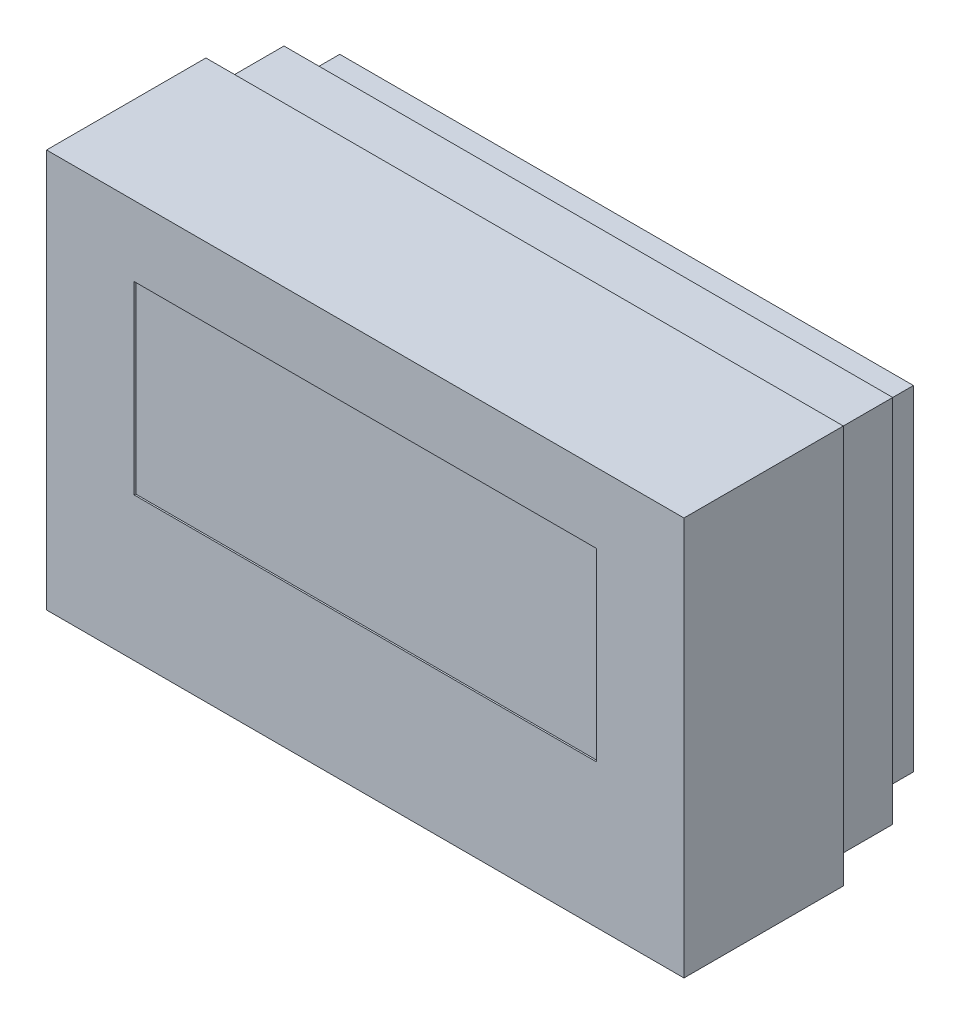
ISO-10303-21;
HEADER;
FILE_DESCRIPTION(('STEP AP214'),'2;1');
FILE_NAME('part.step','',(''),(''),'','','');
FILE_SCHEMA(('AUTOMOTIVE_DESIGN { 1 0 10303 214 1 1 1 1 }'));
ENDSEC;
DATA;
#1=APPLICATION_CONTEXT('core data for automotive mechanical design processes');
#2=APPLICATION_PROTOCOL_DEFINITION('international standard','automotive_design',2000,#1);
#3=PRODUCT_CONTEXT('',#1,'mechanical');
#4=PRODUCT('Part','Part','',(#3));
#5=PRODUCT_RELATED_PRODUCT_CATEGORY('part','',(#4));
#6=PRODUCT_DEFINITION_FORMATION('','',#4);
#7=PRODUCT_DEFINITION_CONTEXT('part definition',#1,'design');
#8=PRODUCT_DEFINITION('design','',#6,#7);
#9=PRODUCT_DEFINITION_SHAPE('','',#8);
#10=(LENGTH_UNIT() NAMED_UNIT(*) SI_UNIT(.MILLI.,.METRE.));
#11=(NAMED_UNIT(*) PLANE_ANGLE_UNIT() SI_UNIT($,.RADIAN.));
#12=(NAMED_UNIT(*) SI_UNIT($,.STERADIAN.) SOLID_ANGLE_UNIT());
#13=UNCERTAINTY_MEASURE_WITH_UNIT(LENGTH_MEASURE(1.E-05),#10,'distance_accuracy_value','');
#14=(GEOMETRIC_REPRESENTATION_CONTEXT(3) GLOBAL_UNCERTAINTY_ASSIGNED_CONTEXT((#13)) GLOBAL_UNIT_ASSIGNED_CONTEXT((#10,
#11,#12)) REPRESENTATION_CONTEXT('',''));
#15=CARTESIAN_POINT('',(0.,0.,0.));
#16=DIRECTION('',(0.,0.,1.));
#17=DIRECTION('',(1.,0.,0.));
#18=AXIS2_PLACEMENT_3D('',#15,#16,#17);
#19=CARTESIAN_POINT('',(19.1,-11.6,-4.));
#20=DIRECTION('',(0.,1.,0.));
#21=DIRECTION('',(0.,0.,1.));
#22=AXIS2_PLACEMENT_3D('',#19,#20,#21);
#23=PLANE('',#22);
#24=DIRECTION('',(-1.,0.,0.));
#25=VECTOR('',#24,1.);
#26=CARTESIAN_POINT('',(19.1,-11.6,-4.));
#27=LINE('',#26,#25);
#28=CARTESIAN_POINT('',(-5.50000000000004,-11.6,-4.));
#29=VERTEX_POINT('',#28);
#30=CARTESIAN_POINT('',(-19.1,-11.6,-4.));
#31=VERTEX_POINT('',#30);
#32=EDGE_CURVE('E281',#29,#31,#27,.T.);
#33=ORIENTED_EDGE('',*,*,#32,.F.);
#34=DIRECTION('',(-0.707106781186544,0.,0.707106781186551));
#35=VECTOR('',#34,1.);
#36=CARTESIAN_POINT('',(6.79999999999986,-11.6,-16.3));
#37=LINE('',#36,#35);
#38=CARTESIAN_POINT('',(-9.50000000000001,-11.6,0.));
#39=VERTEX_POINT('',#38);
#40=EDGE_CURVE('E233',#29,#39,#37,.T.);
#41=ORIENTED_EDGE('',*,*,#40,.T.);
#42=DIRECTION('',(-1.,0.,0.));
#43=VECTOR('',#42,1.);
#44=CARTESIAN_POINT('',(19.1,-11.6,0.));
#45=LINE('',#44,#43);
#46=CARTESIAN_POINT('',(-19.1,-11.6,0.));
#47=VERTEX_POINT('',#46);
#48=EDGE_CURVE('E294',#39,#47,#45,.T.);
#49=ORIENTED_EDGE('',*,*,#48,.T.);
#50=DIRECTION('',(0.,0.,1.));
#51=VECTOR('',#50,1.);
#52=CARTESIAN_POINT('',(-19.1,-11.6,-4.));
#53=LINE('',#52,#51);
#54=EDGE_CURVE('E285',#31,#47,#53,.T.);
#55=ORIENTED_EDGE('',*,*,#54,.F.);
#56=EDGE_LOOP('',(#33,#41,#49,#55));
#57=FACE_BOUND('',#56,.T.);
#58=ADVANCED_FACE('F35',(#57),#23,.F.);
#59=CARTESIAN_POINT('',(0.,0.,0.));
#60=DIRECTION('',(0.,0.,1.));
#61=DIRECTION('',(1.,0.,0.));
#62=AXIS2_PLACEMENT_3D('',#59,#60,#61);
#63=PLANE('',#62);
#64=ORIENTED_EDGE('',*,*,#48,.F.);
#65=DIRECTION('',(0.,-1.,0.));
#66=VECTOR('',#65,1.);
#67=CARTESIAN_POINT('',(-9.50000000000001,14.0153013442625,0.));
#68=LINE('',#67,#66);
#69=CARTESIAN_POINT('',(-9.50000000000001,-12.5,0.));
#70=VERTEX_POINT('',#69);
#71=EDGE_CURVE('E223',#39,#70,#68,.T.);
#72=ORIENTED_EDGE('',*,*,#71,.T.);
#73=DIRECTION('',(1.,0.,0.));
#74=VECTOR('',#73,1.);
#75=CARTESIAN_POINT('',(-20.,-12.5,0.));
#76=LINE('',#75,#74);
#77=CARTESIAN_POINT('',(-20.,-12.5,0.));
#78=VERTEX_POINT('',#77);
#79=EDGE_CURVE('E343',#78,#70,#76,.T.);
#80=ORIENTED_EDGE('',*,*,#79,.F.);
#81=DIRECTION('',(0.,-1.,0.));
#82=VECTOR('',#81,1.);
#83=CARTESIAN_POINT('',(-20.,12.5,0.));
#84=LINE('',#83,#82);
#85=CARTESIAN_POINT('',(-20.,12.5,0.));
#86=VERTEX_POINT('',#85);
#87=EDGE_CURVE('E354',#86,#78,#84,.T.);
#88=ORIENTED_EDGE('',*,*,#87,.F.);
#89=DIRECTION('',(-1.,0.,0.));
#90=VECTOR('',#89,1.);
#91=CARTESIAN_POINT('',(-20.,12.5,0.));
#92=LINE('',#91,#90);
#93=CARTESIAN_POINT('',(20.,12.5,0.));
#94=VERTEX_POINT('',#93);
#95=EDGE_CURVE('E352',#94,#86,#92,.T.);
#96=ORIENTED_EDGE('',*,*,#95,.F.);
#97=DIRECTION('',(0.,1.,0.));
#98=VECTOR('',#97,1.);
#99=CARTESIAN_POINT('',(20.,12.5,0.));
#100=LINE('',#99,#98);
#101=CARTESIAN_POINT('',(20.,-12.5,0.));
#102=VERTEX_POINT('',#101);
#103=EDGE_CURVE('E332',#102,#94,#100,.T.);
#104=ORIENTED_EDGE('',*,*,#103,.F.);
#105=CARTESIAN_POINT('',(14.5,-12.5,0.));
#106=VERTEX_POINT('',#105);
#107=EDGE_CURVE('E356',#106,#102,#76,.T.);
#108=ORIENTED_EDGE('',*,*,#107,.F.);
#109=DIRECTION('',(0.,-1.,0.));
#110=VECTOR('',#109,1.);
#111=CARTESIAN_POINT('',(14.5,14.0153013442625,0.));
#112=LINE('',#111,#110);
#113=CARTESIAN_POINT('',(14.5,-11.6,0.));
#114=VERTEX_POINT('',#113);
#115=EDGE_CURVE('E222',#114,#106,#112,.T.);
#116=ORIENTED_EDGE('',*,*,#115,.F.);
#117=CARTESIAN_POINT('',(19.1,-11.6,0.));
#118=VERTEX_POINT('',#117);
#119=EDGE_CURVE('E277',#118,#114,#45,.T.);
#120=ORIENTED_EDGE('',*,*,#119,.F.);
#121=DIRECTION('',(0.,-1.,0.));
#122=VECTOR('',#121,1.);
#123=CARTESIAN_POINT('',(19.1,11.6,0.));
#124=LINE('',#123,#122);
#125=CARTESIAN_POINT('',(19.1,11.6,0.));
#126=VERTEX_POINT('',#125);
#127=EDGE_CURVE('E291',#126,#118,#124,.T.);
#128=ORIENTED_EDGE('',*,*,#127,.F.);
#129=DIRECTION('',(1.,0.,0.));
#130=VECTOR('',#129,1.);
#131=CARTESIAN_POINT('',(19.1,11.6,0.));
#132=LINE('',#131,#130);
#133=CARTESIAN_POINT('',(-19.1,11.6,0.));
#134=VERTEX_POINT('',#133);
#135=EDGE_CURVE('E288',#134,#126,#132,.T.);
#136=ORIENTED_EDGE('',*,*,#135,.F.);
#137=DIRECTION('',(0.,1.,0.));
#138=VECTOR('',#137,1.);
#139=CARTESIAN_POINT('',(-19.1,11.6,0.));
#140=LINE('',#139,#138);
#141=EDGE_CURVE('E272',#47,#134,#140,.T.);
#142=ORIENTED_EDGE('',*,*,#141,.F.);
#143=EDGE_LOOP('',(#64,#72,#80,#88,#96,#104,#108,#116,#120,#128,#136,#142));
#144=FACE_BOUND('',#143,.T.);
#145=ADVANCED_FACE('F395',(#144),#63,.F.);
#146=CARTESIAN_POINT('',(20.,12.5,10.));
#147=DIRECTION('',(-1.,0.,0.));
#148=DIRECTION('',(0.,0.,1.));
#149=AXIS2_PLACEMENT_3D('',#146,#147,#148);
#150=PLANE('',#149);
#151=ORIENTED_EDGE('',*,*,#103,.T.);
#152=DIRECTION('',(0.,0.,-1.));
#153=VECTOR('',#152,1.);
#154=CARTESIAN_POINT('',(20.,12.5,10.));
#155=LINE('',#154,#153);
#156=CARTESIAN_POINT('',(20.,12.5,10.));
#157=VERTEX_POINT('',#156);
#158=EDGE_CURVE('E206',#157,#94,#155,.T.);
#159=ORIENTED_EDGE('',*,*,#158,.F.);
#160=DIRECTION('',(0.,1.,0.));
#161=VECTOR('',#160,1.);
#162=CARTESIAN_POINT('',(20.,12.5,10.));
#163=LINE('',#162,#161);
#164=CARTESIAN_POINT('',(20.,-12.5,10.));
#165=VERTEX_POINT('',#164);
#166=EDGE_CURVE('E339',#165,#157,#163,.T.);
#167=ORIENTED_EDGE('',*,*,#166,.F.);
#168=DIRECTION('',(0.,0.,-1.));
#169=VECTOR('',#168,1.);
#170=CARTESIAN_POINT('',(20.,-12.5,10.));
#171=LINE('',#170,#169);
#172=EDGE_CURVE('E349',#165,#102,#171,.T.);
#173=ORIENTED_EDGE('',*,*,#172,.T.);
#174=EDGE_LOOP('',(#151,#159,#167,#173));
#175=FACE_BOUND('',#174,.T.);
#176=ADVANCED_FACE('F413',(#175),#150,.F.);
#177=CARTESIAN_POINT('',(-20.,12.5,10.));
#178=DIRECTION('',(0.,-1.,0.));
#179=DIRECTION('',(0.,0.,-1.));
#180=AXIS2_PLACEMENT_3D('',#177,#178,#179);
#181=PLANE('',#180);
#182=ORIENTED_EDGE('',*,*,#95,.T.);
#183=DIRECTION('',(0.,0.,-1.));
#184=VECTOR('',#183,1.);
#185=CARTESIAN_POINT('',(-20.,12.5,10.));
#186=LINE('',#185,#184);
#187=CARTESIAN_POINT('',(-20.,12.5,10.));
#188=VERTEX_POINT('',#187);
#189=EDGE_CURVE('E364',#188,#86,#186,.T.);
#190=ORIENTED_EDGE('',*,*,#189,.F.);
#191=DIRECTION('',(-1.,0.,0.));
#192=VECTOR('',#191,1.);
#193=CARTESIAN_POINT('',(-20.,12.5,10.));
#194=LINE('',#193,#192);
#195=EDGE_CURVE('E342',#157,#188,#194,.T.);
#196=ORIENTED_EDGE('',*,*,#195,.F.);
#197=ORIENTED_EDGE('',*,*,#158,.T.);
#198=EDGE_LOOP('',(#182,#190,#196,#197));
#199=FACE_BOUND('',#198,.T.);
#200=ADVANCED_FACE('F410',(#199),#181,.F.);
#201=CARTESIAN_POINT('',(-20.,12.5,10.));
#202=DIRECTION('',(1.,0.,0.));
#203=DIRECTION('',(0.,0.,-1.));
#204=AXIS2_PLACEMENT_3D('',#201,#202,#203);
#205=PLANE('',#204);
#206=ORIENTED_EDGE('',*,*,#87,.T.);
#207=DIRECTION('',(0.,0.,-1.));
#208=VECTOR('',#207,1.);
#209=CARTESIAN_POINT('',(-20.,-12.5,10.));
#210=LINE('',#209,#208);
#211=CARTESIAN_POINT('',(-20.,-12.5,10.));
#212=VERTEX_POINT('',#211);
#213=EDGE_CURVE('E361',#212,#78,#210,.T.);
#214=ORIENTED_EDGE('',*,*,#213,.F.);
#215=DIRECTION('',(0.,-1.,0.));
#216=VECTOR('',#215,1.);
#217=CARTESIAN_POINT('',(-20.,12.5,10.));
#218=LINE('',#217,#216);
#219=EDGE_CURVE('E345',#188,#212,#218,.T.);
#220=ORIENTED_EDGE('',*,*,#219,.F.);
#221=ORIENTED_EDGE('',*,*,#189,.T.);
#222=EDGE_LOOP('',(#206,#214,#220,#221));
#223=FACE_BOUND('',#222,.T.);
#224=ADVANCED_FACE('F405',(#223),#205,.F.);
#225=CARTESIAN_POINT('',(-20.,-12.5,10.));
#226=DIRECTION('',(0.,1.,0.));
#227=DIRECTION('',(0.,0.,1.));
#228=AXIS2_PLACEMENT_3D('',#225,#226,#227);
#229=PLANE('',#228);
#230=ORIENTED_EDGE('',*,*,#79,.T.);
#231=DIRECTION('',(1.,0.,0.));
#232=VECTOR('',#231,1.);
#233=CARTESIAN_POINT('',(-20.,-12.5,0.));
#234=LINE('',#233,#232);
#235=EDGE_CURVE('E236',#70,#106,#234,.T.);
#236=ORIENTED_EDGE('',*,*,#235,.T.);
#237=ORIENTED_EDGE('',*,*,#107,.T.);
#238=ORIENTED_EDGE('',*,*,#172,.F.);
#239=DIRECTION('',(1.,0.,0.));
#240=VECTOR('',#239,1.);
#241=CARTESIAN_POINT('',(-20.,-12.5,10.));
#242=LINE('',#241,#240);
#243=EDGE_CURVE('E347',#212,#165,#242,.T.);
#244=ORIENTED_EDGE('',*,*,#243,.F.);
#245=ORIENTED_EDGE('',*,*,#213,.T.);
#246=EDGE_LOOP('',(#230,#236,#237,#238,#244,#245));
#247=FACE_BOUND('',#246,.T.);
#248=ADVANCED_FACE('F399',(#247),#229,.F.);
#249=CARTESIAN_POINT('',(0.,0.,10.));
#250=DIRECTION('',(0.,0.,1.));
#251=DIRECTION('',(1.,0.,0.));
#252=AXIS2_PLACEMENT_3D('',#249,#250,#251);
#253=PLANE('',#252);
#254=DIRECTION('',(1.,0.,0.));
#255=VECTOR('',#254,1.);
#256=CARTESIAN_POINT('',(-14.5,-3.5,10.));
#257=LINE('',#256,#255);
#258=CARTESIAN_POINT('',(-14.5,-3.5,10.));
#259=VERTEX_POINT('',#258);
#260=CARTESIAN_POINT('',(14.5,-3.5,10.));
#261=VERTEX_POINT('',#260);
#262=EDGE_CURVE('E308',#259,#261,#257,.T.);
#263=ORIENTED_EDGE('',*,*,#262,.F.);
#264=DIRECTION('',(0.,-1.,0.));
#265=VECTOR('',#264,1.);
#266=CARTESIAN_POINT('',(-14.5,8.1,10.));
#267=LINE('',#266,#265);
#268=CARTESIAN_POINT('',(-14.5,8.1,10.));
#269=VERTEX_POINT('',#268);
#270=EDGE_CURVE('E313',#269,#259,#267,.T.);
#271=ORIENTED_EDGE('',*,*,#270,.F.);
#272=DIRECTION('',(1.,0.,0.));
#273=VECTOR('',#272,1.);
#274=CARTESIAN_POINT('',(-14.5,8.1,10.));
#275=LINE('',#274,#273);
#276=CARTESIAN_POINT('',(14.5,8.1,10.));
#277=VERTEX_POINT('',#276);
#278=EDGE_CURVE('E325',#269,#277,#275,.T.);
#279=ORIENTED_EDGE('',*,*,#278,.T.);
#280=DIRECTION('',(0.,-1.,0.));
#281=VECTOR('',#280,1.);
#282=CARTESIAN_POINT('',(14.5,8.1,10.));
#283=LINE('',#282,#281);
#284=EDGE_CURVE('E322',#277,#261,#283,.T.);
#285=ORIENTED_EDGE('',*,*,#284,.T.);
#286=EDGE_LOOP('',(#263,#271,#279,#285));
#287=FACE_BOUND('',#286,.T.);
#288=ORIENTED_EDGE('',*,*,#166,.T.);
#289=ORIENTED_EDGE('',*,*,#195,.T.);
#290=ORIENTED_EDGE('',*,*,#219,.T.);
#291=ORIENTED_EDGE('',*,*,#243,.T.);
#292=EDGE_LOOP('',(#288,#289,#290,#291));
#293=FACE_BOUND('',#292,.T.);
#294=ADVANCED_FACE('F493',(#287,#293),#253,.T.);
#295=CARTESIAN_POINT('',(-14.5,-3.5,9.9));
#296=DIRECTION('',(0.,-1.,0.));
#297=DIRECTION('',(1.,0.,0.));
#298=AXIS2_PLACEMENT_3D('',#295,#296,#297);
#299=PLANE('',#298);
#300=ORIENTED_EDGE('',*,*,#262,.T.);
#301=DIRECTION('',(0.,0.,1.));
#302=VECTOR('',#301,1.);
#303=CARTESIAN_POINT('',(14.5,-3.5,9.9));
#304=LINE('',#303,#302);
#305=CARTESIAN_POINT('',(14.5,-3.5,9.9));
#306=VERTEX_POINT('',#305);
#307=EDGE_CURVE('E320',#306,#261,#304,.T.);
#308=ORIENTED_EDGE('',*,*,#307,.F.);
#309=DIRECTION('',(1.,0.,0.));
#310=VECTOR('',#309,1.);
#311=CARTESIAN_POINT('',(-14.5,-3.5,9.9));
#312=LINE('',#311,#310);
#313=CARTESIAN_POINT('',(-14.5,-3.5,9.9));
#314=VERTEX_POINT('',#313);
#315=EDGE_CURVE('E309',#314,#306,#312,.T.);
#316=ORIENTED_EDGE('',*,*,#315,.F.);
#317=DIRECTION('',(0.,0.,1.));
#318=VECTOR('',#317,1.);
#319=CARTESIAN_POINT('',(-14.5,-3.5,9.9));
#320=LINE('',#319,#318);
#321=EDGE_CURVE('E330',#314,#259,#320,.T.);
#322=ORIENTED_EDGE('',*,*,#321,.T.);
#323=EDGE_LOOP('',(#300,#308,#316,#322));
#324=FACE_BOUND('',#323,.T.);
#325=ADVANCED_FACE('F483',(#324),#299,.F.);
#326=CARTESIAN_POINT('',(-14.5,8.1,9.9));
#327=DIRECTION('',(-1.,0.,0.));
#328=DIRECTION('',(0.,-1.,0.));
#329=AXIS2_PLACEMENT_3D('',#326,#327,#328);
#330=PLANE('',#329);
#331=ORIENTED_EDGE('',*,*,#270,.T.);
#332=ORIENTED_EDGE('',*,*,#321,.F.);
#333=DIRECTION('',(0.,-1.,0.));
#334=VECTOR('',#333,1.);
#335=CARTESIAN_POINT('',(-14.5,8.1,9.9));
#336=LINE('',#335,#334);
#337=CARTESIAN_POINT('',(-14.5,8.1,9.9));
#338=VERTEX_POINT('',#337);
#339=EDGE_CURVE('E317',#338,#314,#336,.T.);
#340=ORIENTED_EDGE('',*,*,#339,.F.);
#341=DIRECTION('',(0.,0.,1.));
#342=VECTOR('',#341,1.);
#343=CARTESIAN_POINT('',(-14.5,8.1,9.9));
#344=LINE('',#343,#342);
#345=EDGE_CURVE('E333',#338,#269,#344,.T.);
#346=ORIENTED_EDGE('',*,*,#345,.T.);
#347=EDGE_LOOP('',(#331,#332,#340,#346));
#348=FACE_BOUND('',#347,.T.);
#349=ADVANCED_FACE('F479',(#348),#330,.F.);
#350=CARTESIAN_POINT('',(-14.5,8.1,9.9));
#351=DIRECTION('',(0.,-1.,0.));
#352=DIRECTION('',(0.,0.,-1.));
#353=AXIS2_PLACEMENT_3D('',#350,#351,#352);
#354=PLANE('',#353);
#355=ORIENTED_EDGE('',*,*,#278,.F.);
#356=ORIENTED_EDGE('',*,*,#345,.F.);
#357=DIRECTION('',(1.,0.,0.));
#358=VECTOR('',#357,1.);
#359=CARTESIAN_POINT('',(-14.5,8.1,9.9));
#360=LINE('',#359,#358);
#361=CARTESIAN_POINT('',(14.5,8.1,9.9));
#362=VERTEX_POINT('',#361);
#363=EDGE_CURVE('E315',#338,#362,#360,.T.);
#364=ORIENTED_EDGE('',*,*,#363,.T.);
#365=DIRECTION('',(0.,0.,1.));
#366=VECTOR('',#365,1.);
#367=CARTESIAN_POINT('',(14.5,8.1,9.9));
#368=LINE('',#367,#366);
#369=EDGE_CURVE('E335',#362,#277,#368,.T.);
#370=ORIENTED_EDGE('',*,*,#369,.T.);
#371=EDGE_LOOP('',(#355,#356,#364,#370));
#372=FACE_BOUND('',#371,.T.);
#373=ADVANCED_FACE('F482',(#372),#354,.T.);
#374=CARTESIAN_POINT('',(14.5,8.1,9.9));
#375=DIRECTION('',(-1.,0.,0.));
#376=DIRECTION('',(0.,-1.,0.));
#377=AXIS2_PLACEMENT_3D('',#374,#375,#376);
#378=PLANE('',#377);
#379=ORIENTED_EDGE('',*,*,#284,.F.);
#380=ORIENTED_EDGE('',*,*,#369,.F.);
#381=DIRECTION('',(0.,-1.,0.));
#382=VECTOR('',#381,1.);
#383=CARTESIAN_POINT('',(14.5,8.1,9.9));
#384=LINE('',#383,#382);
#385=EDGE_CURVE('E312',#362,#306,#384,.T.);
#386=ORIENTED_EDGE('',*,*,#385,.T.);
#387=ORIENTED_EDGE('',*,*,#307,.T.);
#388=EDGE_LOOP('',(#379,#380,#386,#387));
#389=FACE_BOUND('',#388,.T.);
#390=ADVANCED_FACE('F477',(#389),#378,.T.);
#391=CARTESIAN_POINT('',(0.,0.,9.9));
#392=DIRECTION('',(0.,0.,-1.));
#393=DIRECTION('',(-1.,0.,0.));
#394=AXIS2_PLACEMENT_3D('',#391,#392,#393);
#395=PLANE('',#394);
#396=ORIENTED_EDGE('',*,*,#315,.T.);
#397=ORIENTED_EDGE('',*,*,#385,.F.);
#398=ORIENTED_EDGE('',*,*,#363,.F.);
#399=ORIENTED_EDGE('',*,*,#339,.T.);
#400=EDGE_LOOP('',(#396,#397,#398,#399));
#401=FACE_BOUND('',#400,.T.);
#402=ADVANCED_FACE('F474',(#401),#395,.F.);
#403=CARTESIAN_POINT('',(-19.1,11.6,-4.));
#404=DIRECTION('',(1.,0.,0.));
#405=DIRECTION('',(0.,0.,-1.));
#406=AXIS2_PLACEMENT_3D('',#403,#404,#405);
#407=PLANE('',#406);
#408=ORIENTED_EDGE('',*,*,#141,.T.);
#409=DIRECTION('',(0.,0.,1.));
#410=VECTOR('',#409,1.);
#411=CARTESIAN_POINT('',(-19.1,11.6,-4.));
#412=LINE('',#411,#410);
#413=CARTESIAN_POINT('',(-19.1,11.6,-4.));
#414=VERTEX_POINT('',#413);
#415=EDGE_CURVE('E305',#414,#134,#412,.T.);
#416=ORIENTED_EDGE('',*,*,#415,.F.);
#417=DIRECTION('',(0.,1.,0.));
#418=VECTOR('',#417,1.);
#419=CARTESIAN_POINT('',(-19.1,11.6,-4.));
#420=LINE('',#419,#418);
#421=EDGE_CURVE('E273',#31,#414,#420,.T.);
#422=ORIENTED_EDGE('',*,*,#421,.F.);
#423=ORIENTED_EDGE('',*,*,#54,.T.);
#424=EDGE_LOOP('',(#408,#416,#422,#423));
#425=FACE_BOUND('',#424,.T.);
#426=ADVANCED_FACE('F427',(#425),#407,.F.);
#427=CARTESIAN_POINT('',(19.1,11.6,-4.));
#428=DIRECTION('',(0.,-1.,0.));
#429=DIRECTION('',(0.,0.,-1.));
#430=AXIS2_PLACEMENT_3D('',#427,#428,#429);
#431=PLANE('',#430);
#432=ORIENTED_EDGE('',*,*,#135,.T.);
#433=DIRECTION('',(0.,0.,1.));
#434=VECTOR('',#433,1.);
#435=CARTESIAN_POINT('',(19.1,11.6,-4.));
#436=LINE('',#435,#434);
#437=CARTESIAN_POINT('',(19.1,11.6,-4.));
#438=VERTEX_POINT('',#437);
#439=EDGE_CURVE('E302',#438,#126,#436,.T.);
#440=ORIENTED_EDGE('',*,*,#439,.F.);
#441=DIRECTION('',(1.,0.,0.));
#442=VECTOR('',#441,1.);
#443=CARTESIAN_POINT('',(19.1,11.6,-4.));
#444=LINE('',#443,#442);
#445=EDGE_CURVE('E276',#414,#438,#444,.T.);
#446=ORIENTED_EDGE('',*,*,#445,.F.);
#447=ORIENTED_EDGE('',*,*,#415,.T.);
#448=EDGE_LOOP('',(#432,#440,#446,#447));
#449=FACE_BOUND('',#448,.T.);
#450=ADVANCED_FACE('F423',(#449),#431,.F.);
#451=CARTESIAN_POINT('',(19.1,11.6,-4.));
#452=DIRECTION('',(-1.,0.,0.));
#453=DIRECTION('',(0.,0.,1.));
#454=AXIS2_PLACEMENT_3D('',#451,#452,#453);
#455=PLANE('',#454);
#456=ORIENTED_EDGE('',*,*,#127,.T.);
#457=DIRECTION('',(0.,0.,1.));
#458=VECTOR('',#457,1.);
#459=CARTESIAN_POINT('',(19.1,-11.6,-4.));
#460=LINE('',#459,#458);
#461=CARTESIAN_POINT('',(19.1,-11.6,-4.));
#462=VERTEX_POINT('',#461);
#463=EDGE_CURVE('E299',#462,#118,#460,.T.);
#464=ORIENTED_EDGE('',*,*,#463,.F.);
#465=DIRECTION('',(0.,-1.,0.));
#466=VECTOR('',#465,1.);
#467=CARTESIAN_POINT('',(19.1,11.6,-4.));
#468=LINE('',#467,#466);
#469=EDGE_CURVE('E279',#438,#462,#468,.T.);
#470=ORIENTED_EDGE('',*,*,#469,.F.);
#471=ORIENTED_EDGE('',*,*,#439,.T.);
#472=EDGE_LOOP('',(#456,#464,#470,#471));
#473=FACE_BOUND('',#472,.T.);
#474=ADVANCED_FACE('F420',(#473),#455,.F.);
#475=ORIENTED_EDGE('',*,*,#119,.T.);
#476=DIRECTION('',(-0.707106781186542,0.,-0.707106781186553));
#477=VECTOR('',#476,1.);
#478=CARTESIAN_POINT('',(14.8,-11.6,0.29999999999997));
#479=LINE('',#478,#477);
#480=CARTESIAN_POINT('',(10.5000000000001,-11.6,-4.));
#481=VERTEX_POINT('',#480);
#482=EDGE_CURVE('E229',#114,#481,#479,.T.);
#483=ORIENTED_EDGE('',*,*,#482,.T.);
#484=EDGE_CURVE('E282',#462,#481,#27,.T.);
#485=ORIENTED_EDGE('',*,*,#484,.F.);
#486=ORIENTED_EDGE('',*,*,#463,.T.);
#487=EDGE_LOOP('',(#475,#483,#485,#486));
#488=FACE_BOUND('',#487,.T.);
#489=ADVANCED_FACE('F415',(#488),#23,.F.);
#490=CARTESIAN_POINT('',(0.,0.,-4.));
#491=DIRECTION('',(0.,0.,-1.));
#492=DIRECTION('',(-1.,0.,0.));
#493=AXIS2_PLACEMENT_3D('',#490,#491,#492);
#494=PLANE('',#493);
#495=DIRECTION('',(0.,1.,0.));
#496=VECTOR('',#495,1.);
#497=CARTESIAN_POINT('',(-5.50000000000004,0.,-4.));
#498=LINE('',#497,#496);
#499=CARTESIAN_POINT('',(-5.50000000000004,-10.5,-4.));
#500=VERTEX_POINT('',#499);
#501=EDGE_CURVE('E201',#29,#500,#498,.T.);
#502=ORIENTED_EDGE('',*,*,#501,.F.);
#503=ORIENTED_EDGE('',*,*,#32,.T.);
#504=ORIENTED_EDGE('',*,*,#421,.T.);
#505=ORIENTED_EDGE('',*,*,#445,.T.);
#506=ORIENTED_EDGE('',*,*,#469,.T.);
#507=ORIENTED_EDGE('',*,*,#484,.T.);
#508=DIRECTION('',(0.,-1.,0.));
#509=VECTOR('',#508,1.);
#510=CARTESIAN_POINT('',(10.5000000000001,0.,-4.));
#511=LINE('',#510,#509);
#512=CARTESIAN_POINT('',(10.5000000000001,-10.5,-4.));
#513=VERTEX_POINT('',#512);
#514=EDGE_CURVE('E227',#513,#481,#511,.T.);
#515=ORIENTED_EDGE('',*,*,#514,.F.);
#516=DIRECTION('',(-1.,0.,0.));
#517=VECTOR('',#516,1.);
#518=CARTESIAN_POINT('',(18.,-10.5,-4.));
#519=LINE('',#518,#517);
#520=CARTESIAN_POINT('',(18.,-10.5,-4.));
#521=VERTEX_POINT('',#520);
#522=EDGE_CURVE('E244',#521,#513,#519,.T.);
#523=ORIENTED_EDGE('',*,*,#522,.F.);
#524=DIRECTION('',(0.,-1.,0.));
#525=VECTOR('',#524,1.);
#526=CARTESIAN_POINT('',(18.,10.5,-4.));
#527=LINE('',#526,#525);
#528=CARTESIAN_POINT('',(18.,10.5,-4.));
#529=VERTEX_POINT('',#528);
#530=EDGE_CURVE('E256',#529,#521,#527,.T.);
#531=ORIENTED_EDGE('',*,*,#530,.F.);
#532=DIRECTION('',(1.,0.,0.));
#533=VECTOR('',#532,1.);
#534=CARTESIAN_POINT('',(18.,10.5,-4.));
#535=LINE('',#534,#533);
#536=CARTESIAN_POINT('',(-18.,10.5,-4.));
#537=VERTEX_POINT('',#536);
#538=EDGE_CURVE('E253',#537,#529,#535,.T.);
#539=ORIENTED_EDGE('',*,*,#538,.F.);
#540=DIRECTION('',(0.,1.,0.));
#541=VECTOR('',#540,1.);
#542=CARTESIAN_POINT('',(-18.,10.5,-4.));
#543=LINE('',#542,#541);
#544=CARTESIAN_POINT('',(-18.,-10.5,-4.));
#545=VERTEX_POINT('',#544);
#546=EDGE_CURVE('E239',#545,#537,#543,.T.);
#547=ORIENTED_EDGE('',*,*,#546,.F.);
#548=EDGE_CURVE('E259',#500,#545,#519,.T.);
#549=ORIENTED_EDGE('',*,*,#548,.F.);
#550=EDGE_LOOP('',(#502,#503,#504,#505,#506,#507,#515,#523,#531,#539,#547,#549));
#551=FACE_BOUND('',#550,.T.);
#552=ADVANCED_FACE('F432',(#551),#494,.T.);
#553=CARTESIAN_POINT('',(-18.,10.5,-6.4));
#554=DIRECTION('',(1.,0.,0.));
#555=DIRECTION('',(0.,0.,-1.));
#556=AXIS2_PLACEMENT_3D('',#553,#554,#555);
#557=PLANE('',#556);
#558=ORIENTED_EDGE('',*,*,#546,.T.);
#559=DIRECTION('',(0.,0.,1.));
#560=VECTOR('',#559,1.);
#561=CARTESIAN_POINT('',(-18.,10.5,-6.4));
#562=LINE('',#561,#560);
#563=CARTESIAN_POINT('',(-18.,10.5,-6.4));
#564=VERTEX_POINT('',#563);
#565=EDGE_CURVE('E269',#564,#537,#562,.T.);
#566=ORIENTED_EDGE('',*,*,#565,.F.);
#567=DIRECTION('',(0.,1.,0.));
#568=VECTOR('',#567,1.);
#569=CARTESIAN_POINT('',(-18.,10.5,-6.4));
#570=LINE('',#569,#568);
#571=CARTESIAN_POINT('',(-18.,-10.5,-6.4));
#572=VERTEX_POINT('',#571);
#573=EDGE_CURVE('E240',#572,#564,#570,.T.);
#574=ORIENTED_EDGE('',*,*,#573,.F.);
#575=DIRECTION('',(0.,0.,1.));
#576=VECTOR('',#575,1.);
#577=CARTESIAN_POINT('',(-18.,-10.5,-6.4));
#578=LINE('',#577,#576);
#579=EDGE_CURVE('E250',#572,#545,#578,.T.);
#580=ORIENTED_EDGE('',*,*,#579,.T.);
#581=EDGE_LOOP('',(#558,#566,#574,#580));
#582=FACE_BOUND('',#581,.T.);
#583=ADVANCED_FACE('F439',(#582),#557,.F.);
#584=CARTESIAN_POINT('',(18.,10.5,-6.4));
#585=DIRECTION('',(0.,-1.,0.));
#586=DIRECTION('',(0.,0.,-1.));
#587=AXIS2_PLACEMENT_3D('',#584,#585,#586);
#588=PLANE('',#587);
#589=ORIENTED_EDGE('',*,*,#538,.T.);
#590=DIRECTION('',(0.,0.,1.));
#591=VECTOR('',#590,1.);
#592=CARTESIAN_POINT('',(18.,10.5,-6.4));
#593=LINE('',#592,#591);
#594=CARTESIAN_POINT('',(18.,10.5,-6.4));
#595=VERTEX_POINT('',#594);
#596=EDGE_CURVE('E266',#595,#529,#593,.T.);
#597=ORIENTED_EDGE('',*,*,#596,.F.);
#598=DIRECTION('',(1.,0.,0.));
#599=VECTOR('',#598,1.);
#600=CARTESIAN_POINT('',(18.,10.5,-6.4));
#601=LINE('',#600,#599);
#602=EDGE_CURVE('E243',#564,#595,#601,.T.);
#603=ORIENTED_EDGE('',*,*,#602,.F.);
#604=ORIENTED_EDGE('',*,*,#565,.T.);
#605=EDGE_LOOP('',(#589,#597,#603,#604));
#606=FACE_BOUND('',#605,.T.);
#607=ADVANCED_FACE('F568',(#606),#588,.F.);
#608=CARTESIAN_POINT('',(18.,10.5,-6.4));
#609=DIRECTION('',(-1.,0.,0.));
#610=DIRECTION('',(0.,0.,1.));
#611=AXIS2_PLACEMENT_3D('',#608,#609,#610);
#612=PLANE('',#611);
#613=ORIENTED_EDGE('',*,*,#530,.T.);
#614=DIRECTION('',(0.,0.,1.));
#615=VECTOR('',#614,1.);
#616=CARTESIAN_POINT('',(18.,-10.5,-6.4));
#617=LINE('',#616,#615);
#618=CARTESIAN_POINT('',(18.,-10.5,-6.4));
#619=VERTEX_POINT('',#618);
#620=EDGE_CURVE('E263',#619,#521,#617,.T.);
#621=ORIENTED_EDGE('',*,*,#620,.F.);
#622=DIRECTION('',(0.,-1.,0.));
#623=VECTOR('',#622,1.);
#624=CARTESIAN_POINT('',(18.,10.5,-6.4));
#625=LINE('',#624,#623);
#626=EDGE_CURVE('E246',#595,#619,#625,.T.);
#627=ORIENTED_EDGE('',*,*,#626,.F.);
#628=ORIENTED_EDGE('',*,*,#596,.T.);
#629=EDGE_LOOP('',(#613,#621,#627,#628));
#630=FACE_BOUND('',#629,.T.);
#631=ADVANCED_FACE('F446',(#630),#612,.F.);
#632=CARTESIAN_POINT('',(18.,-10.5,-6.4));
#633=DIRECTION('',(0.,1.,0.));
#634=DIRECTION('',(0.,0.,1.));
#635=AXIS2_PLACEMENT_3D('',#632,#633,#634);
#636=PLANE('',#635);
#637=DIRECTION('',(1.,0.,0.));
#638=VECTOR('',#637,1.);
#639=CARTESIAN_POINT('',(9.50000000000002,-10.5,-5.00000000000006));
#640=LINE('',#639,#638);
#641=CARTESIAN_POINT('',(-4.49999999999999,-10.5,-5.00000000000006));
#642=VERTEX_POINT('',#641);
#643=CARTESIAN_POINT('',(9.50000000000002,-10.5,-5.00000000000006));
#644=VERTEX_POINT('',#643);
#645=EDGE_CURVE('E209',#642,#644,#640,.T.);
#646=ORIENTED_EDGE('',*,*,#645,.F.);
#647=DIRECTION('',(-0.707106781186544,0.,0.707106781186551));
#648=VECTOR('',#647,1.);
#649=CARTESIAN_POINT('',(7.44999999999986,-10.5,-16.95));
#650=LINE('',#649,#648);
#651=EDGE_CURVE('E195',#642,#500,#650,.T.);
#652=ORIENTED_EDGE('',*,*,#651,.T.);
#653=ORIENTED_EDGE('',*,*,#548,.T.);
#654=ORIENTED_EDGE('',*,*,#579,.F.);
#655=DIRECTION('',(-1.,0.,0.));
#656=VECTOR('',#655,1.);
#657=CARTESIAN_POINT('',(18.,-10.5,-6.4));
#658=LINE('',#657,#656);
#659=EDGE_CURVE('E248',#619,#572,#658,.T.);
#660=ORIENTED_EDGE('',*,*,#659,.F.);
#661=ORIENTED_EDGE('',*,*,#620,.T.);
#662=ORIENTED_EDGE('',*,*,#522,.T.);
#663=DIRECTION('',(0.707106781186542,0.,0.707106781186553));
#664=VECTOR('',#663,1.);
#665=CARTESIAN_POINT('',(14.5,-10.5,0.));
#666=LINE('',#665,#664);
#667=EDGE_CURVE('E215',#644,#513,#666,.T.);
#668=ORIENTED_EDGE('',*,*,#667,.F.);
#669=EDGE_LOOP('',(#646,#652,#653,#654,#660,#661,#662,#668));
#670=FACE_BOUND('',#669,.T.);
#671=ADVANCED_FACE('F213',(#670),#636,.F.);
#672=CARTESIAN_POINT('',(0.,0.,-6.4));
#673=DIRECTION('',(0.,0.,-1.));
#674=DIRECTION('',(-1.,0.,0.));
#675=AXIS2_PLACEMENT_3D('',#672,#673,#674);
#676=PLANE('',#675);
#677=ORIENTED_EDGE('',*,*,#573,.T.);
#678=ORIENTED_EDGE('',*,*,#602,.T.);
#679=ORIENTED_EDGE('',*,*,#626,.T.);
#680=ORIENTED_EDGE('',*,*,#659,.T.);
#681=EDGE_LOOP('',(#677,#678,#679,#680));
#682=FACE_BOUND('',#681,.T.);
#683=ADVANCED_FACE('F441',(#682),#676,.T.);
#684=CARTESIAN_POINT('',(-4.49999999999999,14.0153013442625,-5.00000000000006));
#685=DIRECTION('',(-0.707106781186551,0.,-0.707106781186544));
#686=DIRECTION('',(-0.707106781186544,0.,0.707106781186551));
#687=AXIS2_PLACEMENT_3D('',#684,#685,#686);
#688=PLANE('',#687);
#689=DIRECTION('',(0.707106781186544,0.,-0.707106781186551));
#690=VECTOR('',#689,1.);
#691=CARTESIAN_POINT('',(-4.49999999999999,-14.4,-5.00000000000006));
#692=LINE('',#691,#690);
#693=CARTESIAN_POINT('',(-7.50250156445621,-14.4,-1.99749843554381));
#694=VERTEX_POINT('',#693);
#695=CARTESIAN_POINT('',(-6.49999999999997,-14.4,-3.00000000000006));
#696=VERTEX_POINT('',#695);
#697=EDGE_CURVE('E390',#694,#696,#692,.T.);
#698=ORIENTED_EDGE('',*,*,#697,.F.);
#699=CARTESIAN_POINT('',(-7.50250156445621,-12.4,-1.99749843554381));
#700=DIRECTION('',(-0.707106781186551,0.,-0.707106781186544));
#701=DIRECTION('',(-0.707106781186544,0.,0.707106781186551));
#702=AXIS2_PLACEMENT_3D('',#699,#700,#701);
#703=ELLIPSE('',#702,2.82842712474618,2.);
#704=EDGE_CURVE('E376',#694,#70,#703,.T.);
#705=ORIENTED_EDGE('',*,*,#704,.T.);
#706=ORIENTED_EDGE('',*,*,#71,.F.);
#707=ORIENTED_EDGE('',*,*,#40,.F.);
#708=ORIENTED_EDGE('',*,*,#501,.T.);
#709=ORIENTED_EDGE('',*,*,#651,.F.);
#710=DIRECTION('',(0.,-1.,0.));
#711=VECTOR('',#710,1.);
#712=CARTESIAN_POINT('',(-4.49999999999999,14.0153013442625,-5.00000000000006));
#713=LINE('',#712,#711);
#714=CARTESIAN_POINT('',(-4.49999999999999,-12.4,-5.00000000000006));
#715=VERTEX_POINT('',#714);
#716=EDGE_CURVE('E198',#642,#715,#713,.T.);
#717=ORIENTED_EDGE('',*,*,#716,.T.);
#718=CARTESIAN_POINT('',(-6.49999999999997,-12.4,-3.00000000000006));
#719=DIRECTION('',(-0.707106781186551,0.,-0.707106781186544));
#720=DIRECTION('',(-0.707106781186544,0.,0.707106781186551));
#721=AXIS2_PLACEMENT_3D('',#718,#719,#720);
#722=ELLIPSE('',#721,2.82842712474618,2.);
#723=EDGE_CURVE('E374',#715,#696,#722,.T.);
#724=ORIENTED_EDGE('',*,*,#723,.T.);
#725=EDGE_LOOP('',(#698,#705,#706,#707,#708,#709,#717,#724));
#726=FACE_BOUND('',#725,.T.);
#727=ADVANCED_FACE('F197',(#726),#688,.T.);
#728=CARTESIAN_POINT('',(14.5,14.0153013442625,0.));
#729=DIRECTION('',(0.707106781186553,0.,-0.707106781186541));
#730=DIRECTION('',(-0.707106781186542,0.,-0.707106781186553));
#731=AXIS2_PLACEMENT_3D('',#728,#729,#730);
#732=PLANE('',#731);
#733=ORIENTED_EDGE('',*,*,#115,.T.);
#734=CARTESIAN_POINT('',(12.5025015644562,-12.4,-1.99749843554381));
#735=DIRECTION('',(0.707106781186553,0.,-0.707106781186541));
#736=DIRECTION('',(-0.707106781186542,0.,-0.707106781186553));
#737=AXIS2_PLACEMENT_3D('',#734,#735,#736);
#738=ELLIPSE('',#737,2.82842712474617,2.);
#739=CARTESIAN_POINT('',(12.5025015644562,-14.4,-1.99749843554381));
#740=VERTEX_POINT('',#739);
#741=EDGE_CURVE('E43',#106,#740,#738,.T.);
#742=ORIENTED_EDGE('',*,*,#741,.T.);
#743=DIRECTION('',(0.707106781186542,0.,0.707106781186554));
#744=VECTOR('',#743,1.);
#745=CARTESIAN_POINT('',(14.5,-14.4,0.));
#746=LINE('',#745,#744);
#747=CARTESIAN_POINT('',(11.5,-14.4,-3.00000000000006));
#748=VERTEX_POINT('',#747);
#749=EDGE_CURVE('E210',#748,#740,#746,.T.);
#750=ORIENTED_EDGE('',*,*,#749,.F.);
#751=CARTESIAN_POINT('',(11.5,-12.4,-3.00000000000006));
#752=DIRECTION('',(0.707106781186553,0.,-0.707106781186541));
#753=DIRECTION('',(-0.707106781186542,0.,-0.707106781186553));
#754=AXIS2_PLACEMENT_3D('',#751,#752,#753);
#755=ELLIPSE('',#754,2.82842712474617,2.);
#756=CARTESIAN_POINT('',(9.50000000000002,-12.4,-5.00000000000006));
#757=VERTEX_POINT('',#756);
#758=EDGE_CURVE('E50',#748,#757,#755,.T.);
#759=ORIENTED_EDGE('',*,*,#758,.T.);
#760=DIRECTION('',(0.,-1.,0.));
#761=VECTOR('',#760,1.);
#762=CARTESIAN_POINT('',(9.50000000000002,14.0153013442625,-5.00000000000006));
#763=LINE('',#762,#761);
#764=EDGE_CURVE('E216',#644,#757,#763,.T.);
#765=ORIENTED_EDGE('',*,*,#764,.F.);
#766=ORIENTED_EDGE('',*,*,#667,.T.);
#767=ORIENTED_EDGE('',*,*,#514,.T.);
#768=ORIENTED_EDGE('',*,*,#482,.F.);
#769=EDGE_LOOP('',(#733,#742,#750,#759,#765,#766,#767,#768));
#770=FACE_BOUND('',#769,.T.);
#771=ADVANCED_FACE('F380',(#770),#732,.T.);
#772=CARTESIAN_POINT('',(9.50000000000002,14.0153013442625,-5.00000000000006));
#773=DIRECTION('',(0.,0.,-1.));
#774=DIRECTION('',(-1.,0.,0.));
#775=AXIS2_PLACEMENT_3D('',#772,#773,#774);
#776=PLANE('',#775);
#777=ORIENTED_EDGE('',*,*,#764,.T.);
#778=DIRECTION('',(1.,0.,0.));
#779=VECTOR('',#778,1.);
#780=CARTESIAN_POINT('',(-4.49999999999999,-12.4,-5.00000000000006));
#781=LINE('',#780,#779);
#782=EDGE_CURVE('E11',#757,#715,#781,.F.);
#783=ORIENTED_EDGE('',*,*,#782,.T.);
#784=ORIENTED_EDGE('',*,*,#716,.F.);
#785=ORIENTED_EDGE('',*,*,#645,.T.);
#786=EDGE_LOOP('',(#777,#783,#784,#785));
#787=FACE_BOUND('',#786,.T.);
#788=ADVANCED_FACE('F208',(#787),#776,.T.);
#789=CARTESIAN_POINT('',(0.,-14.4,0.));
#790=DIRECTION('',(0.,1.,0.));
#791=DIRECTION('',(0.,0.,1.));
#792=AXIS2_PLACEMENT_3D('',#789,#790,#791);
#793=PLANE('',#792);
#794=ORIENTED_EDGE('',*,*,#749,.T.);
#795=DIRECTION('',(-1.,0.,0.));
#796=VECTOR('',#795,1.);
#797=CARTESIAN_POINT('',(0.,-14.4,-1.99749843554381));
#798=LINE('',#797,#796);
#799=EDGE_CURVE('E371',#740,#694,#798,.T.);
#800=ORIENTED_EDGE('',*,*,#799,.T.);
#801=ORIENTED_EDGE('',*,*,#697,.T.);
#802=DIRECTION('',(1.,0.,0.));
#803=VECTOR('',#802,1.);
#804=CARTESIAN_POINT('',(9.50000000000002,-14.4,-3.00000000000006));
#805=LINE('',#804,#803);
#806=EDGE_CURVE('E205',#696,#748,#805,.T.);
#807=ORIENTED_EDGE('',*,*,#806,.T.);
#808=EDGE_LOOP('',(#794,#800,#801,#807));
#809=FACE_BOUND('',#808,.T.);
#810=ADVANCED_FACE('F387',(#809),#793,.F.);
#811=CARTESIAN_POINT('',(-9.50000000000001,-12.4,-1.99749843554381));
#812=DIRECTION('',(-1.,0.,0.));
#813=DIRECTION('',(0.,0.,1.));
#814=AXIS2_PLACEMENT_3D('',#811,#812,#813);
#815=CYLINDRICAL_SURFACE('',#814,2.);
#816=ORIENTED_EDGE('',*,*,#741,.F.);
#817=ORIENTED_EDGE('',*,*,#235,.F.);
#818=ORIENTED_EDGE('',*,*,#704,.F.);
#819=ORIENTED_EDGE('',*,*,#799,.F.);
#820=EDGE_LOOP('',(#816,#817,#818,#819));
#821=FACE_BOUND('',#820,.T.);
#822=ADVANCED_FACE('F391',(#821),#815,.T.);
#823=CARTESIAN_POINT('',(0.,-12.4,-3.00000000000006));
#824=DIRECTION('',(-1.,0.,0.));
#825=DIRECTION('',(0.,0.,1.));
#826=AXIS2_PLACEMENT_3D('',#823,#824,#825);
#827=CYLINDRICAL_SURFACE('',#826,2.);
#828=ORIENTED_EDGE('',*,*,#723,.F.);
#829=ORIENTED_EDGE('',*,*,#782,.F.);
#830=ORIENTED_EDGE('',*,*,#758,.F.);
#831=ORIENTED_EDGE('',*,*,#806,.F.);
#832=EDGE_LOOP('',(#828,#829,#830,#831));
#833=FACE_BOUND('',#832,.T.);
#834=ADVANCED_FACE('F37',(#833),#827,.T.);
#835=CLOSED_SHELL('',(#58,#145,#176,#200,#224,#248,#294,#325,#349,#373,#390,#402,#426,#450,#474,
#489,#552,#583,#607,#631,#671,#683,#727,#771,#788,#810,#822,#834));
#836=MANIFOLD_SOLID_BREP('B2',#835);
#837=ADVANCED_BREP_SHAPE_REPRESENTATION('',(#18,#836),#14);
#838=SHAPE_DEFINITION_REPRESENTATION(#9,#837);
ENDSEC;
END-ISO-10303-21;
